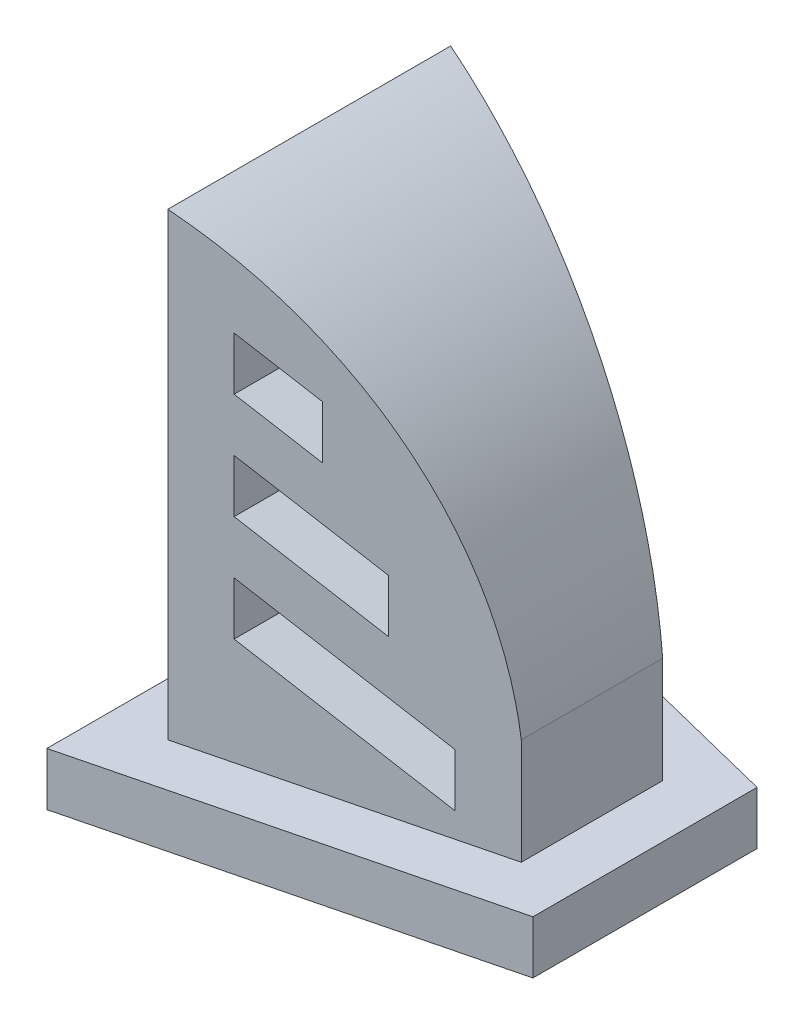
ISO-10303-21;
HEADER;
FILE_DESCRIPTION(('STEP AP214'),'2;1');
FILE_NAME('part.step','',(''),(''),'','','');
FILE_SCHEMA(('AUTOMOTIVE_DESIGN { 1 0 10303 214 1 1 1 1 }'));
ENDSEC;
DATA;
#1=APPLICATION_CONTEXT('core data for automotive mechanical design processes');
#2=APPLICATION_PROTOCOL_DEFINITION('international standard','automotive_design',2000,#1);
#3=PRODUCT_CONTEXT('',#1,'mechanical');
#4=PRODUCT('Part','Part','',(#3));
#5=PRODUCT_RELATED_PRODUCT_CATEGORY('part','',(#4));
#6=PRODUCT_DEFINITION_FORMATION('','',#4);
#7=PRODUCT_DEFINITION_CONTEXT('part definition',#1,'design');
#8=PRODUCT_DEFINITION('design','',#6,#7);
#9=PRODUCT_DEFINITION_SHAPE('','',#8);
#10=(LENGTH_UNIT() NAMED_UNIT(*) SI_UNIT(.MILLI.,.METRE.));
#11=(NAMED_UNIT(*) PLANE_ANGLE_UNIT() SI_UNIT($,.RADIAN.));
#12=(NAMED_UNIT(*) SI_UNIT($,.STERADIAN.) SOLID_ANGLE_UNIT());
#13=UNCERTAINTY_MEASURE_WITH_UNIT(LENGTH_MEASURE(1.E-05),#10,'distance_accuracy_value','');
#14=(GEOMETRIC_REPRESENTATION_CONTEXT(3) GLOBAL_UNCERTAINTY_ASSIGNED_CONTEXT((#13)) GLOBAL_UNIT_ASSIGNED_CONTEXT((#10,
#11,#12)) REPRESENTATION_CONTEXT('',''));
#15=CARTESIAN_POINT('',(0.,0.,0.));
#16=DIRECTION('',(0.,0.,1.));
#17=DIRECTION('',(1.,0.,0.));
#18=AXIS2_PLACEMENT_3D('',#15,#16,#17);
#19=CARTESIAN_POINT('',(15.,15.,11.7116460960662));
#20=DIRECTION('',(0.,-1.,0.));
#21=DIRECTION('',(0.,0.,-1.));
#22=AXIS2_PLACEMENT_3D('',#19,#20,#21);
#23=PLANE('',#22);
#24=DIRECTION('',(0.,0.,-1.));
#25=VECTOR('',#24,1.);
#26=CARTESIAN_POINT('',(15.,15.,-51.7116460960662));
#27=LINE('',#26,#25);
#28=CARTESIAN_POINT('',(15.,15.,11.7116460960662));
#29=VERTEX_POINT('',#28);
#30=CARTESIAN_POINT('',(15.,15.,-51.7116460960662));
#31=VERTEX_POINT('',#30);
#32=EDGE_CURVE('E226',#29,#31,#27,.T.);
#33=ORIENTED_EDGE('',*,*,#32,.T.);
#34=DIRECTION('',(-0.970142500145332,0.,-0.242535625036333));
#35=VECTOR('',#34,1.);
#36=CARTESIAN_POINT('',(-95.,15.,-79.2116460960662));
#37=LINE('',#36,#35);
#38=CARTESIAN_POINT('',(-95.,15.,-79.2116460960662));
#39=VERTEX_POINT('',#38);
#40=EDGE_CURVE('E238',#31,#39,#37,.T.);
#41=ORIENTED_EDGE('',*,*,#40,.T.);
#42=DIRECTION('',(0.,0.,1.));
#43=VECTOR('',#42,1.);
#44=CARTESIAN_POINT('',(-95.,15.,39.2116460960662));
#45=LINE('',#44,#43);
#46=CARTESIAN_POINT('',(-95.,15.,39.2116460960662));
#47=VERTEX_POINT('',#46);
#48=EDGE_CURVE('E236',#39,#47,#45,.T.);
#49=ORIENTED_EDGE('',*,*,#48,.T.);
#50=DIRECTION('',(0.970142500145332,0.,-0.242535625036333));
#51=VECTOR('',#50,1.);
#52=CARTESIAN_POINT('',(15.,15.,11.7116460960662));
#53=LINE('',#52,#51);
#54=EDGE_CURVE('E223',#47,#29,#53,.T.);
#55=ORIENTED_EDGE('',*,*,#54,.T.);
#56=EDGE_LOOP('',(#33,#41,#49,#55));
#57=FACE_BOUND('',#56,.T.);
#58=DIRECTION('',(0.970142500145332,0.,-0.242535625036333));
#59=VECTOR('',#58,1.);
#60=CARTESIAN_POINT('',(-80.,15.,20.));
#61=LINE('',#60,#59);
#62=CARTESIAN_POINT('',(-80.,15.,20.));
#63=VERTEX_POINT('',#62);
#64=CARTESIAN_POINT('',(0.,15.,0.));
#65=VERTEX_POINT('',#64);
#66=EDGE_CURVE('E261',#63,#65,#61,.T.);
#67=ORIENTED_EDGE('',*,*,#66,.F.);
#68=DIRECTION('',(0.,0.,1.));
#69=VECTOR('',#68,1.);
#70=CARTESIAN_POINT('',(-80.,15.,-60.));
#71=LINE('',#70,#69);
#72=CARTESIAN_POINT('',(-80.,15.,-60.));
#73=VERTEX_POINT('',#72);
#74=EDGE_CURVE('E252',#73,#63,#71,.T.);
#75=ORIENTED_EDGE('',*,*,#74,.F.);
#76=DIRECTION('',(-0.970142500145332,0.,-0.242535625036333));
#77=VECTOR('',#76,1.);
#78=CARTESIAN_POINT('',(0.,15.,-40.));
#79=LINE('',#78,#77);
#80=CARTESIAN_POINT('',(0.,15.,-40.));
#81=VERTEX_POINT('',#80);
#82=EDGE_CURVE('E255',#81,#73,#79,.T.);
#83=ORIENTED_EDGE('',*,*,#82,.F.);
#84=DIRECTION('',(0.,0.,-1.));
#85=VECTOR('',#84,1.);
#86=CARTESIAN_POINT('',(0.,15.,0.));
#87=LINE('',#86,#85);
#88=EDGE_CURVE('E258',#65,#81,#87,.T.);
#89=ORIENTED_EDGE('',*,*,#88,.F.);
#90=EDGE_LOOP('',(#67,#75,#83,#89));
#91=FACE_BOUND('',#90,.T.);
#92=ADVANCED_FACE('F31',(#57,#91),#23,.F.);
#93=CARTESIAN_POINT('',(15.,15.,-51.7116460960662));
#94=DIRECTION('',(-1.,0.,0.));
#95=DIRECTION('',(0.,0.,1.));
#96=AXIS2_PLACEMENT_3D('',#93,#94,#95);
#97=PLANE('',#96);
#98=DIRECTION('',(0.,0.,-1.));
#99=VECTOR('',#98,1.);
#100=CARTESIAN_POINT('',(15.,0.,-51.7116460960662));
#101=LINE('',#100,#99);
#102=CARTESIAN_POINT('',(15.,0.,11.7116460960662));
#103=VERTEX_POINT('',#102);
#104=CARTESIAN_POINT('',(15.,0.,-51.7116460960662));
#105=VERTEX_POINT('',#104);
#106=EDGE_CURVE('E231',#103,#105,#101,.T.);
#107=ORIENTED_EDGE('',*,*,#106,.T.);
#108=DIRECTION('',(0.,-1.,0.));
#109=VECTOR('',#108,1.);
#110=CARTESIAN_POINT('',(15.,15.,-51.7116460960662));
#111=LINE('',#110,#109);
#112=EDGE_CURVE('E211',#31,#105,#111,.T.);
#113=ORIENTED_EDGE('',*,*,#112,.F.);
#114=ORIENTED_EDGE('',*,*,#32,.F.);
#115=DIRECTION('',(0.,-1.,0.));
#116=VECTOR('',#115,1.);
#117=CARTESIAN_POINT('',(15.,15.,11.7116460960662));
#118=LINE('',#117,#116);
#119=EDGE_CURVE('E220',#29,#103,#118,.T.);
#120=ORIENTED_EDGE('',*,*,#119,.T.);
#121=EDGE_LOOP('',(#107,#113,#114,#120));
#122=FACE_BOUND('',#121,.T.);
#123=ADVANCED_FACE('F33',(#122),#97,.F.);
#124=CARTESIAN_POINT('',(-95.,15.,-79.2116460960662));
#125=DIRECTION('',(-0.242535625036333,0.,0.970142500145332));
#126=DIRECTION('',(0.970142500145332,0.,0.242535625036333));
#127=AXIS2_PLACEMENT_3D('',#124,#125,#126);
#128=PLANE('',#127);
#129=DIRECTION('',(-0.970142500145332,0.,-0.242535625036333));
#130=VECTOR('',#129,1.);
#131=CARTESIAN_POINT('',(-95.,0.,-79.2116460960662));
#132=LINE('',#131,#130);
#133=CARTESIAN_POINT('',(-95.,0.,-79.2116460960662));
#134=VERTEX_POINT('',#133);
#135=EDGE_CURVE('E229',#105,#134,#132,.T.);
#136=ORIENTED_EDGE('',*,*,#135,.T.);
#137=DIRECTION('',(0.,-1.,0.));
#138=VECTOR('',#137,1.);
#139=CARTESIAN_POINT('',(-95.,15.,-79.2116460960662));
#140=LINE('',#139,#138);
#141=EDGE_CURVE('E214',#39,#134,#140,.T.);
#142=ORIENTED_EDGE('',*,*,#141,.F.);
#143=ORIENTED_EDGE('',*,*,#40,.F.);
#144=ORIENTED_EDGE('',*,*,#112,.T.);
#145=EDGE_LOOP('',(#136,#142,#143,#144));
#146=FACE_BOUND('',#145,.T.);
#147=ADVANCED_FACE('F354',(#146),#128,.F.);
#148=CARTESIAN_POINT('',(-95.,15.,39.2116460960662));
#149=DIRECTION('',(1.,0.,0.));
#150=DIRECTION('',(0.,0.,-1.));
#151=AXIS2_PLACEMENT_3D('',#148,#149,#150);
#152=PLANE('',#151);
#153=DIRECTION('',(0.,0.,1.));
#154=VECTOR('',#153,1.);
#155=CARTESIAN_POINT('',(-95.,0.,39.2116460960662));
#156=LINE('',#155,#154);
#157=CARTESIAN_POINT('',(-95.,0.,39.2116460960662));
#158=VERTEX_POINT('',#157);
#159=EDGE_CURVE('E227',#134,#158,#156,.T.);
#160=ORIENTED_EDGE('',*,*,#159,.T.);
#161=DIRECTION('',(0.,-1.,0.));
#162=VECTOR('',#161,1.);
#163=CARTESIAN_POINT('',(-95.,15.,39.2116460960662));
#164=LINE('',#163,#162);
#165=EDGE_CURVE('E217',#47,#158,#164,.T.);
#166=ORIENTED_EDGE('',*,*,#165,.F.);
#167=ORIENTED_EDGE('',*,*,#48,.F.);
#168=ORIENTED_EDGE('',*,*,#141,.T.);
#169=EDGE_LOOP('',(#160,#166,#167,#168));
#170=FACE_BOUND('',#169,.T.);
#171=ADVANCED_FACE('F367',(#170),#152,.F.);
#172=CARTESIAN_POINT('',(15.,15.,11.7116460960662));
#173=DIRECTION('',(-0.242535625036333,0.,-0.970142500145332));
#174=DIRECTION('',(-0.970142500145332,0.,0.242535625036333));
#175=AXIS2_PLACEMENT_3D('',#172,#173,#174);
#176=PLANE('',#175);
#177=DIRECTION('',(0.970142500145332,0.,-0.242535625036333));
#178=VECTOR('',#177,1.);
#179=CARTESIAN_POINT('',(15.,0.,11.7116460960662));
#180=LINE('',#179,#178);
#181=EDGE_CURVE('E224',#158,#103,#180,.T.);
#182=ORIENTED_EDGE('',*,*,#181,.T.);
#183=ORIENTED_EDGE('',*,*,#119,.F.);
#184=ORIENTED_EDGE('',*,*,#54,.F.);
#185=ORIENTED_EDGE('',*,*,#165,.T.);
#186=EDGE_LOOP('',(#182,#183,#184,#185));
#187=FACE_BOUND('',#186,.T.);
#188=ADVANCED_FACE('F363',(#187),#176,.F.);
#189=CARTESIAN_POINT('',(15.,0.,11.7116460960662));
#190=DIRECTION('',(0.,-1.,0.));
#191=DIRECTION('',(0.,0.,-1.));
#192=AXIS2_PLACEMENT_3D('',#189,#190,#191);
#193=PLANE('',#192);
#194=ORIENTED_EDGE('',*,*,#106,.F.);
#195=ORIENTED_EDGE('',*,*,#181,.F.);
#196=ORIENTED_EDGE('',*,*,#159,.F.);
#197=ORIENTED_EDGE('',*,*,#135,.F.);
#198=EDGE_LOOP('',(#194,#195,#196,#197));
#199=FACE_BOUND('',#198,.T.);
#200=ADVANCED_FACE('F360',(#199),#193,.T.);
#201=CARTESIAN_POINT('',(-80.,145.,20.));
#202=DIRECTION('',(-0.242535625036333,0.,-0.970142500145332));
#203=DIRECTION('',(-0.970142500145332,0.,0.242535625036333));
#204=AXIS2_PLACEMENT_3D('',#201,#202,#203);
#205=PLANE('',#204);
#206=DIRECTION('',(0.,-1.,0.));
#207=VECTOR('',#206,1.);
#208=CARTESIAN_POINT('',(-45.,145.,11.25));
#209=LINE('',#208,#207);
#210=CARTESIAN_POINT('',(-45.,110.983844616975,11.25));
#211=VERTEX_POINT('',#210);
#212=CARTESIAN_POINT('',(-45.,95.983844616975,11.25));
#213=VERTEX_POINT('',#212);
#214=EDGE_CURVE('E327',#211,#213,#209,.T.);
#215=ORIENTED_EDGE('',*,*,#214,.T.);
#216=DIRECTION('',(-0.883903215348616,0.412170838384888,0.220975803837154));
#217=VECTOR('',#216,1.);
#218=CARTESIAN_POINT('',(-91.9115550513015,117.859061993357,22.9778887628254));
#219=LINE('',#218,#217);
#220=CARTESIAN_POINT('',(-65.,105.309997780075,16.25));
#221=VERTEX_POINT('',#220);
#222=EDGE_CURVE('E177',#213,#221,#219,.T.);
#223=ORIENTED_EDGE('',*,*,#222,.T.);
#224=DIRECTION('',(0.,1.,0.));
#225=VECTOR('',#224,1.);
#226=CARTESIAN_POINT('',(-65.,145.,16.25));
#227=LINE('',#226,#225);
#228=CARTESIAN_POINT('',(-65.,120.309997780075,16.25));
#229=VERTEX_POINT('',#228);
#230=EDGE_CURVE('E321',#221,#229,#227,.T.);
#231=ORIENTED_EDGE('',*,*,#230,.T.);
#232=DIRECTION('',(0.883903215348617,-0.412170838384887,-0.220975803837154));
#233=VECTOR('',#232,1.);
#234=CARTESIAN_POINT('',(-86.4467681114815,130.310789993133,21.6116920278704));
#235=LINE('',#234,#233);
#236=EDGE_CURVE('E324',#229,#211,#235,.T.);
#237=ORIENTED_EDGE('',*,*,#236,.T.);
#238=EDGE_LOOP('',(#215,#223,#231,#237));
#239=FACE_BOUND('',#238,.T.);
#240=DIRECTION('',(-0.883903215348616,0.412170838384887,0.220975803837154));
#241=VECTOR('',#240,1.);
#242=CARTESIAN_POINT('',(-102.841128930942,92.9556059938038,25.7102822327354));
#243=LINE('',#242,#241);
#244=CARTESIAN_POINT('',(-30.,58.98922974465,7.50000000000002));
#245=VERTEX_POINT('',#244);
#246=CARTESIAN_POINT('',(-65.,75.309997780075,16.25));
#247=VERTEX_POINT('',#246);
#248=EDGE_CURVE('E306',#245,#247,#243,.T.);
#249=ORIENTED_EDGE('',*,*,#248,.T.);
#250=DIRECTION('',(0.,1.,0.));
#251=VECTOR('',#250,1.);
#252=CARTESIAN_POINT('',(-65.0000000000001,145.,16.25));
#253=LINE('',#252,#251);
#254=CARTESIAN_POINT('',(-65.,90.309997780075,16.25));
#255=VERTEX_POINT('',#254);
#256=EDGE_CURVE('E290',#247,#255,#253,.T.);
#257=ORIENTED_EDGE('',*,*,#256,.T.);
#258=DIRECTION('',(0.883903215348616,-0.412170838384888,-0.220975803837154));
#259=VECTOR('',#258,1.);
#260=CARTESIAN_POINT('',(-97.3763419911216,105.40733399358,24.3440854977804));
#261=LINE('',#260,#259);
#262=CARTESIAN_POINT('',(-30.,73.98922974465,7.50000000000001));
#263=VERTEX_POINT('',#262);
#264=EDGE_CURVE('E300',#255,#263,#261,.T.);
#265=ORIENTED_EDGE('',*,*,#264,.T.);
#266=DIRECTION('',(0.,-1.,0.));
#267=VECTOR('',#266,1.);
#268=CARTESIAN_POINT('',(-30.,145.,7.50000000000001));
#269=LINE('',#268,#267);
#270=EDGE_CURVE('E303',#263,#245,#269,.T.);
#271=ORIENTED_EDGE('',*,*,#270,.T.);
#272=EDGE_LOOP('',(#249,#257,#265,#271));
#273=FACE_BOUND('',#272,.T.);
#274=DIRECTION('',(-0.883903215348616,0.412170838384888,0.220975803837154));
#275=VECTOR('',#274,1.);
#276=CARTESIAN_POINT('',(-113.770702810582,68.0521499942508,28.4426757026454));
#277=LINE('',#276,#275);
#278=CARTESIAN_POINT('',(-15.,21.994614872325,3.75000000000003));
#279=VERTEX_POINT('',#278);
#280=CARTESIAN_POINT('',(-65.,45.309997780075,16.25));
#281=VERTEX_POINT('',#280);
#282=EDGE_CURVE('E283',#279,#281,#277,.T.);
#283=ORIENTED_EDGE('',*,*,#282,.T.);
#284=DIRECTION('',(0.,1.,0.));
#285=VECTOR('',#284,1.);
#286=CARTESIAN_POINT('',(-64.9999999999999,145.,16.25));
#287=LINE('',#286,#285);
#288=CARTESIAN_POINT('',(-65.,60.309997780075,16.25));
#289=VERTEX_POINT('',#288);
#290=EDGE_CURVE('E274',#281,#289,#287,.T.);
#291=ORIENTED_EDGE('',*,*,#290,.T.);
#292=DIRECTION('',(0.883903215348616,-0.412170838384888,-0.220975803837154));
#293=VECTOR('',#292,1.);
#294=CARTESIAN_POINT('',(-108.305915870762,80.5038779940273,27.0764789676904));
#295=LINE('',#294,#293);
#296=CARTESIAN_POINT('',(-15.,36.994614872325,3.75));
#297=VERTEX_POINT('',#296);
#298=EDGE_CURVE('E277',#289,#297,#295,.T.);
#299=ORIENTED_EDGE('',*,*,#298,.T.);
#300=DIRECTION('',(0.,-1.,0.));
#301=VECTOR('',#300,1.);
#302=CARTESIAN_POINT('',(-15.,145.,3.75000000000001));
#303=LINE('',#302,#301);
#304=EDGE_CURVE('E280',#297,#279,#303,.T.);
#305=ORIENTED_EDGE('',*,*,#304,.T.);
#306=EDGE_LOOP('',(#283,#291,#299,#305));
#307=FACE_BOUND('',#306,.T.);
#308=DIRECTION('',(0.,-1.,0.));
#309=VECTOR('',#308,1.);
#310=CARTESIAN_POINT('',(0.,145.,0.));
#311=LINE('',#310,#309);
#312=CARTESIAN_POINT('',(0.,45.,0.));
#313=VERTEX_POINT('',#312);
#314=EDGE_CURVE('E234',#313,#65,#311,.T.);
#315=ORIENTED_EDGE('',*,*,#314,.F.);
#316=CARTESIAN_POINT('',(-119.249528736,31.6003770112002,29.812382184));
#317=DIRECTION('',(-0.242535625036333,0.,-0.970142500145332));
#318=DIRECTION('',(-0.970142500145332,0.,0.242535625036333));
#319=AXIS2_PLACEMENT_3D('',#316,#317,#318);
#320=ELLIPSE('',#319,123.69316876853,120.);
#321=CARTESIAN_POINT('',(-80.,145.,20.));
#322=VERTEX_POINT('',#321);
#323=EDGE_CURVE('E264',#313,#322,#320,.F.);
#324=ORIENTED_EDGE('',*,*,#323,.T.);
#325=DIRECTION('',(0.,-1.,0.));
#326=VECTOR('',#325,1.);
#327=CARTESIAN_POINT('',(-80.,145.,20.));
#328=LINE('',#327,#326);
#329=EDGE_CURVE('E248',#322,#63,#328,.T.);
#330=ORIENTED_EDGE('',*,*,#329,.T.);
#331=ORIENTED_EDGE('',*,*,#66,.T.);
#332=EDGE_LOOP('',(#315,#324,#330,#331));
#333=FACE_BOUND('',#332,.T.);
#334=ADVANCED_FACE('F334',(#239,#273,#307,#333),#205,.F.);
#335=CARTESIAN_POINT('',(0.,145.,0.));
#336=DIRECTION('',(-1.,0.,0.));
#337=DIRECTION('',(0.,0.,1.));
#338=AXIS2_PLACEMENT_3D('',#335,#336,#337);
#339=PLANE('',#338);
#340=DIRECTION('',(0.,-1.,0.));
#341=VECTOR('',#340,1.);
#342=CARTESIAN_POINT('',(0.,145.,-40.));
#343=LINE('',#342,#341);
#344=CARTESIAN_POINT('',(0.,45.,-40.));
#345=VERTEX_POINT('',#344);
#346=EDGE_CURVE('E243',#345,#81,#343,.T.);
#347=ORIENTED_EDGE('',*,*,#346,.F.);
#348=DIRECTION('',(0.,0.,1.));
#349=VECTOR('',#348,1.);
#350=CARTESIAN_POINT('',(0.,45.,-65.));
#351=LINE('',#350,#349);
#352=EDGE_CURVE('E271',#345,#313,#351,.T.);
#353=ORIENTED_EDGE('',*,*,#352,.T.);
#354=ORIENTED_EDGE('',*,*,#314,.T.);
#355=ORIENTED_EDGE('',*,*,#88,.T.);
#356=EDGE_LOOP('',(#347,#353,#354,#355));
#357=FACE_BOUND('',#356,.T.);
#358=ADVANCED_FACE('F405',(#357),#339,.F.);
#359=CARTESIAN_POINT('',(0.,145.,-40.));
#360=DIRECTION('',(-0.242535625036333,0.,0.970142500145332));
#361=DIRECTION('',(0.970142500145332,0.,0.242535625036333));
#362=AXIS2_PLACEMENT_3D('',#359,#360,#361);
#363=PLANE('',#362);
#364=DIRECTION('',(0.,-1.,0.));
#365=VECTOR('',#364,1.);
#366=CARTESIAN_POINT('',(-65.,145.,-56.25));
#367=LINE('',#366,#365);
#368=CARTESIAN_POINT('',(-65.,120.309997780075,-56.25));
#369=VERTEX_POINT('',#368);
#370=CARTESIAN_POINT('',(-65.,105.309997780075,-56.25));
#371=VERTEX_POINT('',#370);
#372=EDGE_CURVE('E39',#369,#371,#367,.T.);
#373=ORIENTED_EDGE('',*,*,#372,.T.);
#374=DIRECTION('',(0.883903215348616,-0.412170838384888,0.220975803837154));
#375=VECTOR('',#374,1.);
#376=CARTESIAN_POINT('',(-25.5023390524936,86.8919360010431,-46.3755847631234));
#377=LINE('',#376,#375);
#378=CARTESIAN_POINT('',(-45.,95.983844616975,-51.25));
#379=VERTEX_POINT('',#378);
#380=EDGE_CURVE('E11',#371,#379,#377,.T.);
#381=ORIENTED_EDGE('',*,*,#380,.T.);
#382=DIRECTION('',(0.,1.,0.));
#383=VECTOR('',#382,1.);
#384=CARTESIAN_POINT('',(-45.,145.,-51.25));
#385=LINE('',#384,#383);
#386=CARTESIAN_POINT('',(-45.,110.983844616975,-51.25));
#387=VERTEX_POINT('',#386);
#388=EDGE_CURVE('E165',#379,#387,#385,.T.);
#389=ORIENTED_EDGE('',*,*,#388,.T.);
#390=DIRECTION('',(-0.883903215348616,0.412170838384887,-0.220975803837154));
#391=VECTOR('',#390,1.);
#392=CARTESIAN_POINT('',(-20.0375521126735,99.3436640008196,-45.0093880281684));
#393=LINE('',#392,#391);
#394=EDGE_CURVE('E169',#387,#369,#393,.T.);
#395=ORIENTED_EDGE('',*,*,#394,.T.);
#396=EDGE_LOOP('',(#373,#381,#389,#395));
#397=FACE_BOUND('',#396,.T.);
#398=DIRECTION('',(-0.883903215348616,0.412170838384888,-0.220975803837154));
#399=VECTOR('',#398,1.);
#400=CARTESIAN_POINT('',(-30.9671259923137,74.4402080012666,-47.7417814980784));
#401=LINE('',#400,#399);
#402=CARTESIAN_POINT('',(-30.,73.98922974465,-47.5));
#403=VERTEX_POINT('',#402);
#404=CARTESIAN_POINT('',(-65.,90.309997780075,-56.25));
#405=VERTEX_POINT('',#404);
#406=EDGE_CURVE('E190',#403,#405,#401,.T.);
#407=ORIENTED_EDGE('',*,*,#406,.T.);
#408=DIRECTION('',(0.,-1.,0.));
#409=VECTOR('',#408,1.);
#410=CARTESIAN_POINT('',(-65.0000000000001,145.,-56.25));
#411=LINE('',#410,#409);
#412=CARTESIAN_POINT('',(-65.,75.309997780075,-56.25));
#413=VERTEX_POINT('',#412);
#414=EDGE_CURVE('E170',#405,#413,#411,.T.);
#415=ORIENTED_EDGE('',*,*,#414,.T.);
#416=DIRECTION('',(0.883903215348616,-0.412170838384888,0.220975803837154));
#417=VECTOR('',#416,1.);
#418=CARTESIAN_POINT('',(-36.4319129321337,61.9884800014901,-49.1079782330334));
#419=LINE('',#418,#417);
#420=CARTESIAN_POINT('',(-30.,58.98922974465,-47.5));
#421=VERTEX_POINT('',#420);
#422=EDGE_CURVE('E196',#413,#421,#419,.T.);
#423=ORIENTED_EDGE('',*,*,#422,.T.);
#424=DIRECTION('',(0.,1.,0.));
#425=VECTOR('',#424,1.);
#426=CARTESIAN_POINT('',(-30.,145.,-47.5));
#427=LINE('',#426,#425);
#428=EDGE_CURVE('E193',#421,#403,#427,.T.);
#429=ORIENTED_EDGE('',*,*,#428,.T.);
#430=EDGE_LOOP('',(#407,#415,#423,#429));
#431=FACE_BOUND('',#430,.T.);
#432=DIRECTION('',(-0.883903215348616,0.412170838384888,-0.220975803837154));
#433=VECTOR('',#432,1.);
#434=CARTESIAN_POINT('',(-41.8966998719538,49.5367520017137,-50.4741749679884));
#435=LINE('',#434,#433);
#436=CARTESIAN_POINT('',(-15.,36.994614872325,-43.75));
#437=VERTEX_POINT('',#436);
#438=CARTESIAN_POINT('',(-65.,60.309997780075,-56.25));
#439=VERTEX_POINT('',#438);
#440=EDGE_CURVE('E202',#437,#439,#435,.T.);
#441=ORIENTED_EDGE('',*,*,#440,.T.);
#442=DIRECTION('',(0.,-1.,0.));
#443=VECTOR('',#442,1.);
#444=CARTESIAN_POINT('',(-64.9999999999999,145.,-56.25));
#445=LINE('',#444,#443);
#446=CARTESIAN_POINT('',(-65.,45.309997780075,-56.25));
#447=VERTEX_POINT('',#446);
#448=EDGE_CURVE('E199',#439,#447,#445,.T.);
#449=ORIENTED_EDGE('',*,*,#448,.T.);
#450=DIRECTION('',(0.883903215348616,-0.412170838384888,0.220975803837154));
#451=VECTOR('',#450,1.);
#452=CARTESIAN_POINT('',(-47.3614868117739,37.0850240019372,-51.8403717029435));
#453=LINE('',#452,#451);
#454=CARTESIAN_POINT('',(-15.,21.994614872325,-43.75));
#455=VERTEX_POINT('',#454);
#456=EDGE_CURVE('E208',#447,#455,#453,.T.);
#457=ORIENTED_EDGE('',*,*,#456,.T.);
#458=DIRECTION('',(0.,1.,0.));
#459=VECTOR('',#458,1.);
#460=CARTESIAN_POINT('',(-15.,145.,-43.75));
#461=LINE('',#460,#459);
#462=EDGE_CURVE('E205',#455,#437,#461,.T.);
#463=ORIENTED_EDGE('',*,*,#462,.T.);
#464=EDGE_LOOP('',(#441,#449,#457,#463));
#465=FACE_BOUND('',#464,.T.);
#466=DIRECTION('',(0.,-1.,0.));
#467=VECTOR('',#466,1.);
#468=CARTESIAN_POINT('',(-80.,145.,-60.));
#469=LINE('',#468,#467);
#470=CARTESIAN_POINT('',(-80.,145.,-60.));
#471=VERTEX_POINT('',#470);
#472=EDGE_CURVE('E245',#471,#73,#469,.T.);
#473=ORIENTED_EDGE('',*,*,#472,.F.);
#474=CARTESIAN_POINT('',(-119.249528736,31.6003770112002,-69.8123821839999));
#475=DIRECTION('',(-0.242535625036333,0.,0.970142500145332));
#476=DIRECTION('',(0.970142500145332,0.,0.242535625036333));
#477=AXIS2_PLACEMENT_3D('',#474,#475,#476);
#478=ELLIPSE('',#477,123.69316876853,120.);
#479=EDGE_CURVE('E268',#471,#345,#478,.F.);
#480=ORIENTED_EDGE('',*,*,#479,.T.);
#481=ORIENTED_EDGE('',*,*,#346,.T.);
#482=ORIENTED_EDGE('',*,*,#82,.T.);
#483=EDGE_LOOP('',(#473,#480,#481,#482));
#484=FACE_BOUND('',#483,.T.);
#485=ADVANCED_FACE('F181',(#397,#431,#465,#484),#363,.F.);
#486=CARTESIAN_POINT('',(-80.,145.,-60.));
#487=DIRECTION('',(1.,0.,0.));
#488=DIRECTION('',(0.,0.,-1.));
#489=AXIS2_PLACEMENT_3D('',#486,#487,#488);
#490=PLANE('',#489);
#491=ORIENTED_EDGE('',*,*,#74,.T.);
#492=ORIENTED_EDGE('',*,*,#329,.F.);
#493=DIRECTION('',(0.,0.,1.));
#494=VECTOR('',#493,1.);
#495=CARTESIAN_POINT('',(-80.,145.,-60.));
#496=LINE('',#495,#494);
#497=EDGE_CURVE('E251',#471,#322,#496,.T.);
#498=ORIENTED_EDGE('',*,*,#497,.F.);
#499=ORIENTED_EDGE('',*,*,#472,.T.);
#500=EDGE_LOOP('',(#491,#492,#498,#499));
#501=FACE_BOUND('',#500,.T.);
#502=ADVANCED_FACE('F417',(#501),#490,.F.);
#503=CARTESIAN_POINT('',(-119.249528736,31.6003770112002,-65.));
#504=DIRECTION('',(0.,0.,1.));
#505=DIRECTION('',(1.,0.,0.));
#506=AXIS2_PLACEMENT_3D('',#503,#504,#505);
#507=CYLINDRICAL_SURFACE('',#506,120.);
#508=ORIENTED_EDGE('',*,*,#352,.F.);
#509=ORIENTED_EDGE('',*,*,#479,.F.);
#510=ORIENTED_EDGE('',*,*,#497,.T.);
#511=ORIENTED_EDGE('',*,*,#323,.F.);
#512=EDGE_LOOP('',(#508,#509,#510,#511));
#513=FACE_BOUND('',#512,.T.);
#514=ADVANCED_FACE('F424',(#513),#507,.T.);
#515=CARTESIAN_POINT('',(-65.,60.309997780075,-65.));
#516=DIRECTION('',(-1.,0.,0.));
#517=DIRECTION('',(0.,-1.,0.));
#518=AXIS2_PLACEMENT_3D('',#515,#516,#517);
#519=PLANE('',#518);
#520=DIRECTION('',(0.,0.,1.));
#521=VECTOR('',#520,1.);
#522=CARTESIAN_POINT('',(-65.,45.309997780075,-65.));
#523=LINE('',#522,#521);
#524=EDGE_CURVE('E287',#447,#281,#523,.T.);
#525=ORIENTED_EDGE('',*,*,#524,.F.);
#526=ORIENTED_EDGE('',*,*,#448,.F.);
#527=DIRECTION('',(0.,0.,1.));
#528=VECTOR('',#527,1.);
#529=CARTESIAN_POINT('',(-65.,60.309997780075,-65.));
#530=LINE('',#529,#528);
#531=EDGE_CURVE('E286',#439,#289,#530,.T.);
#532=ORIENTED_EDGE('',*,*,#531,.T.);
#533=ORIENTED_EDGE('',*,*,#290,.F.);
#534=EDGE_LOOP('',(#525,#526,#532,#533));
#535=FACE_BOUND('',#534,.T.);
#536=ADVANCED_FACE('F432',(#535),#519,.F.);
#537=CARTESIAN_POINT('',(-65.,60.309997780075,-65.));
#538=DIRECTION('',(0.4226182617407,0.906307787036649,0.));
#539=DIRECTION('',(-0.906307787036649,0.4226182617407,0.));
#540=AXIS2_PLACEMENT_3D('',#537,#538,#539);
#541=PLANE('',#540);
#542=ORIENTED_EDGE('',*,*,#531,.F.);
#543=ORIENTED_EDGE('',*,*,#440,.F.);
#544=DIRECTION('',(0.,0.,1.));
#545=VECTOR('',#544,1.);
#546=CARTESIAN_POINT('',(-15.,36.994614872325,-65.));
#547=LINE('',#546,#545);
#548=EDGE_CURVE('E293',#437,#297,#547,.T.);
#549=ORIENTED_EDGE('',*,*,#548,.T.);
#550=ORIENTED_EDGE('',*,*,#298,.F.);
#551=EDGE_LOOP('',(#542,#543,#549,#550));
#552=FACE_BOUND('',#551,.T.);
#553=ADVANCED_FACE('F440',(#552),#541,.F.);
#554=CARTESIAN_POINT('',(-15.,36.994614872325,-65.));
#555=DIRECTION('',(1.,0.,0.));
#556=DIRECTION('',(0.,0.,-1.));
#557=AXIS2_PLACEMENT_3D('',#554,#555,#556);
#558=PLANE('',#557);
#559=ORIENTED_EDGE('',*,*,#548,.F.);
#560=ORIENTED_EDGE('',*,*,#462,.F.);
#561=DIRECTION('',(0.,0.,1.));
#562=VECTOR('',#561,1.);
#563=CARTESIAN_POINT('',(-15.,21.994614872325,-65.));
#564=LINE('',#563,#562);
#565=EDGE_CURVE('E289',#455,#279,#564,.T.);
#566=ORIENTED_EDGE('',*,*,#565,.T.);
#567=ORIENTED_EDGE('',*,*,#304,.F.);
#568=EDGE_LOOP('',(#559,#560,#566,#567));
#569=FACE_BOUND('',#568,.T.);
#570=ADVANCED_FACE('F448',(#569),#558,.F.);
#571=CARTESIAN_POINT('',(-65.,45.309997780075,-65.));
#572=DIRECTION('',(-0.4226182617407,-0.90630778703665,0.));
#573=DIRECTION('',(0.90630778703665,-0.4226182617407,0.));
#574=AXIS2_PLACEMENT_3D('',#571,#572,#573);
#575=PLANE('',#574);
#576=ORIENTED_EDGE('',*,*,#565,.F.);
#577=ORIENTED_EDGE('',*,*,#456,.F.);
#578=ORIENTED_EDGE('',*,*,#524,.T.);
#579=ORIENTED_EDGE('',*,*,#282,.F.);
#580=EDGE_LOOP('',(#576,#577,#578,#579));
#581=FACE_BOUND('',#580,.T.);
#582=ADVANCED_FACE('F456',(#581),#575,.F.);
#583=CARTESIAN_POINT('',(-65.,90.309997780075,-65.));
#584=DIRECTION('',(-1.,0.,0.));
#585=DIRECTION('',(0.,-1.,0.));
#586=AXIS2_PLACEMENT_3D('',#583,#584,#585);
#587=PLANE('',#586);
#588=DIRECTION('',(0.,0.,1.));
#589=VECTOR('',#588,1.);
#590=CARTESIAN_POINT('',(-65.,75.309997780075,-65.));
#591=LINE('',#590,#589);
#592=EDGE_CURVE('E310',#413,#247,#591,.T.);
#593=ORIENTED_EDGE('',*,*,#592,.F.);
#594=ORIENTED_EDGE('',*,*,#414,.F.);
#595=DIRECTION('',(0.,0.,1.));
#596=VECTOR('',#595,1.);
#597=CARTESIAN_POINT('',(-65.,90.309997780075,-65.));
#598=LINE('',#597,#596);
#599=EDGE_CURVE('E309',#405,#255,#598,.T.);
#600=ORIENTED_EDGE('',*,*,#599,.T.);
#601=ORIENTED_EDGE('',*,*,#256,.F.);
#602=EDGE_LOOP('',(#593,#594,#600,#601));
#603=FACE_BOUND('',#602,.T.);
#604=ADVANCED_FACE('F464',(#603),#587,.F.);
#605=CARTESIAN_POINT('',(-30.,73.98922974465,-65.));
#606=DIRECTION('',(0.4226182617407,0.906307787036649,0.));
#607=DIRECTION('',(-0.906307787036649,0.4226182617407,0.));
#608=AXIS2_PLACEMENT_3D('',#605,#606,#607);
#609=PLANE('',#608);
#610=ORIENTED_EDGE('',*,*,#599,.F.);
#611=ORIENTED_EDGE('',*,*,#406,.F.);
#612=DIRECTION('',(0.,0.,1.));
#613=VECTOR('',#612,1.);
#614=CARTESIAN_POINT('',(-30.,73.98922974465,-65.));
#615=LINE('',#614,#613);
#616=EDGE_CURVE('E315',#403,#263,#615,.T.);
#617=ORIENTED_EDGE('',*,*,#616,.T.);
#618=ORIENTED_EDGE('',*,*,#264,.F.);
#619=EDGE_LOOP('',(#610,#611,#617,#618));
#620=FACE_BOUND('',#619,.T.);
#621=ADVANCED_FACE('F472',(#620),#609,.F.);
#622=CARTESIAN_POINT('',(-30.,58.98922974465,-65.));
#623=DIRECTION('',(1.,0.,0.));
#624=DIRECTION('',(0.,0.,-1.));
#625=AXIS2_PLACEMENT_3D('',#622,#623,#624);
#626=PLANE('',#625);
#627=ORIENTED_EDGE('',*,*,#616,.F.);
#628=ORIENTED_EDGE('',*,*,#428,.F.);
#629=DIRECTION('',(0.,0.,1.));
#630=VECTOR('',#629,1.);
#631=CARTESIAN_POINT('',(-30.,58.98922974465,-65.));
#632=LINE('',#631,#630);
#633=EDGE_CURVE('E312',#421,#245,#632,.T.);
#634=ORIENTED_EDGE('',*,*,#633,.T.);
#635=ORIENTED_EDGE('',*,*,#270,.F.);
#636=EDGE_LOOP('',(#627,#628,#634,#635));
#637=FACE_BOUND('',#636,.T.);
#638=ADVANCED_FACE('F480',(#637),#626,.F.);
#639=CARTESIAN_POINT('',(-65.,75.309997780075,-65.));
#640=DIRECTION('',(-0.4226182617407,-0.90630778703665,0.));
#641=DIRECTION('',(0.90630778703665,-0.4226182617407,0.));
#642=AXIS2_PLACEMENT_3D('',#639,#640,#641);
#643=PLANE('',#642);
#644=ORIENTED_EDGE('',*,*,#633,.F.);
#645=ORIENTED_EDGE('',*,*,#422,.F.);
#646=ORIENTED_EDGE('',*,*,#592,.T.);
#647=ORIENTED_EDGE('',*,*,#248,.F.);
#648=EDGE_LOOP('',(#644,#645,#646,#647));
#649=FACE_BOUND('',#648,.T.);
#650=ADVANCED_FACE('F346',(#649),#643,.F.);
#651=CARTESIAN_POINT('',(-65.,105.309997780075,-65.));
#652=DIRECTION('',(-0.4226182617407,-0.90630778703665,0.));
#653=DIRECTION('',(0.90630778703665,-0.4226182617407,0.));
#654=AXIS2_PLACEMENT_3D('',#651,#652,#653);
#655=PLANE('',#654);
#656=DIRECTION('',(0.,0.,1.));
#657=VECTOR('',#656,1.);
#658=CARTESIAN_POINT('',(-45.,95.983844616975,-65.));
#659=LINE('',#658,#657);
#660=EDGE_CURVE('E46',#379,#213,#659,.T.);
#661=ORIENTED_EDGE('',*,*,#660,.F.);
#662=ORIENTED_EDGE('',*,*,#380,.F.);
#663=DIRECTION('',(0.,0.,1.));
#664=VECTOR('',#663,1.);
#665=CARTESIAN_POINT('',(-65.,105.309997780075,-65.));
#666=LINE('',#665,#664);
#667=EDGE_CURVE('E328',#371,#221,#666,.T.);
#668=ORIENTED_EDGE('',*,*,#667,.T.);
#669=ORIENTED_EDGE('',*,*,#222,.F.);
#670=EDGE_LOOP('',(#661,#662,#668,#669));
#671=FACE_BOUND('',#670,.T.);
#672=ADVANCED_FACE('F173',(#671),#655,.F.);
#673=CARTESIAN_POINT('',(-65.,120.309997780075,-65.));
#674=DIRECTION('',(-1.,0.,0.));
#675=DIRECTION('',(0.,0.,1.));
#676=AXIS2_PLACEMENT_3D('',#673,#674,#675);
#677=PLANE('',#676);
#678=ORIENTED_EDGE('',*,*,#667,.F.);
#679=ORIENTED_EDGE('',*,*,#372,.F.);
#680=DIRECTION('',(0.,0.,1.));
#681=VECTOR('',#680,1.);
#682=CARTESIAN_POINT('',(-65.,120.309997780075,-65.));
#683=LINE('',#682,#681);
#684=EDGE_CURVE('E331',#369,#229,#683,.T.);
#685=ORIENTED_EDGE('',*,*,#684,.T.);
#686=ORIENTED_EDGE('',*,*,#230,.F.);
#687=EDGE_LOOP('',(#678,#679,#685,#686));
#688=FACE_BOUND('',#687,.T.);
#689=ADVANCED_FACE('F338',(#688),#677,.F.);
#690=CARTESIAN_POINT('',(-45.,110.983844616975,-65.));
#691=DIRECTION('',(0.4226182617407,0.90630778703665,0.));
#692=DIRECTION('',(-0.90630778703665,0.4226182617407,0.));
#693=AXIS2_PLACEMENT_3D('',#690,#691,#692);
#694=PLANE('',#693);
#695=ORIENTED_EDGE('',*,*,#684,.F.);
#696=ORIENTED_EDGE('',*,*,#394,.F.);
#697=DIRECTION('',(0.,0.,1.));
#698=VECTOR('',#697,1.);
#699=CARTESIAN_POINT('',(-45.,110.983844616975,-65.));
#700=LINE('',#699,#698);
#701=EDGE_CURVE('E51',#387,#211,#700,.T.);
#702=ORIENTED_EDGE('',*,*,#701,.T.);
#703=ORIENTED_EDGE('',*,*,#236,.F.);
#704=EDGE_LOOP('',(#695,#696,#702,#703));
#705=FACE_BOUND('',#704,.T.);
#706=ADVANCED_FACE('F337',(#705),#694,.F.);
#707=CARTESIAN_POINT('',(-45.,95.983844616975,-65.));
#708=DIRECTION('',(1.,0.,0.));
#709=DIRECTION('',(0.,0.,-1.));
#710=AXIS2_PLACEMENT_3D('',#707,#708,#709);
#711=PLANE('',#710);
#712=ORIENTED_EDGE('',*,*,#701,.F.);
#713=ORIENTED_EDGE('',*,*,#388,.F.);
#714=ORIENTED_EDGE('',*,*,#660,.T.);
#715=ORIENTED_EDGE('',*,*,#214,.F.);
#716=EDGE_LOOP('',(#712,#713,#714,#715));
#717=FACE_BOUND('',#716,.T.);
#718=ADVANCED_FACE('F166',(#717),#711,.F.);
#719=CLOSED_SHELL('',(#92,#123,#147,#171,#188,#200,#334,#358,#485,#502,#514,#536,#553,#570,#582,
#604,#621,#638,#650,#672,#689,#706,#718));
#720=MANIFOLD_SOLID_BREP('B2',#719);
#721=ADVANCED_BREP_SHAPE_REPRESENTATION('',(#18,#720),#14);
#722=SHAPE_DEFINITION_REPRESENTATION(#9,#721);
ENDSEC;
END-ISO-10303-21;
